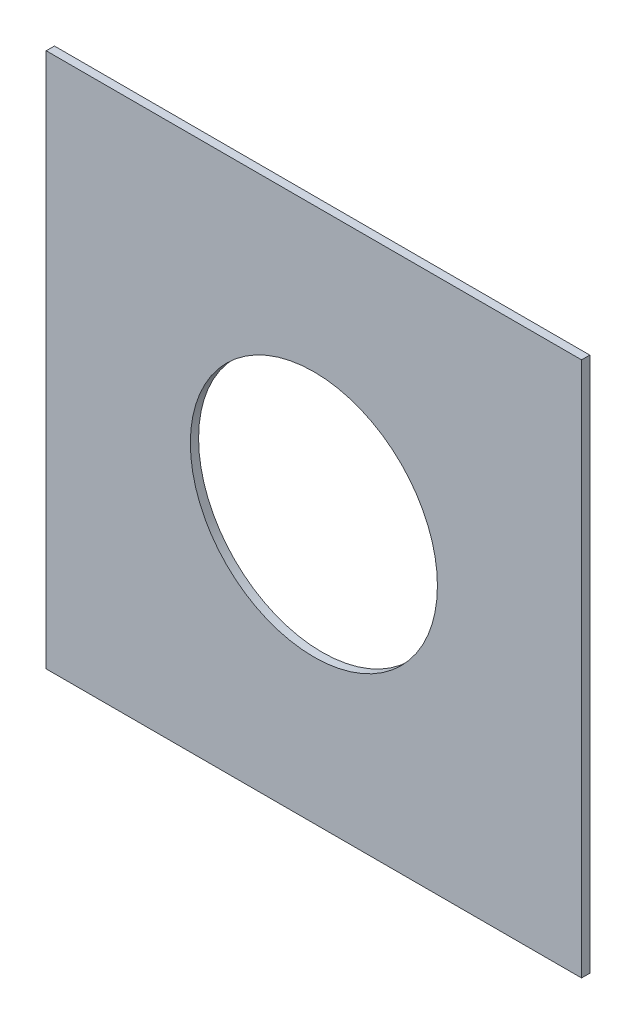
ISO-10303-21;
HEADER;
FILE_DESCRIPTION(('STEP AP214'),'2;1');
FILE_NAME('part.step','',(''),(''),'','','');
FILE_SCHEMA(('AUTOMOTIVE_DESIGN { 1 0 10303 214 1 1 1 1 }'));
ENDSEC;
DATA;
#1=APPLICATION_CONTEXT('core data for automotive mechanical design processes');
#2=APPLICATION_PROTOCOL_DEFINITION('international standard','automotive_design',2000,#1);
#3=PRODUCT_CONTEXT('',#1,'mechanical');
#4=PRODUCT('Part','Part','',(#3));
#5=PRODUCT_RELATED_PRODUCT_CATEGORY('part','',(#4));
#6=PRODUCT_DEFINITION_FORMATION('','',#4);
#7=PRODUCT_DEFINITION_CONTEXT('part definition',#1,'design');
#8=PRODUCT_DEFINITION('design','',#6,#7);
#9=PRODUCT_DEFINITION_SHAPE('','',#8);
#10=(LENGTH_UNIT() NAMED_UNIT(*) SI_UNIT(.MILLI.,.METRE.));
#11=(NAMED_UNIT(*) PLANE_ANGLE_UNIT() SI_UNIT($,.RADIAN.));
#12=(NAMED_UNIT(*) SI_UNIT($,.STERADIAN.) SOLID_ANGLE_UNIT());
#13=UNCERTAINTY_MEASURE_WITH_UNIT(LENGTH_MEASURE(1.E-05),#10,'distance_accuracy_value','');
#14=(GEOMETRIC_REPRESENTATION_CONTEXT(3) GLOBAL_UNCERTAINTY_ASSIGNED_CONTEXT((#13)) GLOBAL_UNIT_ASSIGNED_CONTEXT((#10,
#11,#12)) REPRESENTATION_CONTEXT('',''));
#15=CARTESIAN_POINT('',(0.,0.,0.));
#16=DIRECTION('',(0.,0.,1.));
#17=DIRECTION('',(1.,0.,0.));
#18=AXIS2_PLACEMENT_3D('',#15,#16,#17);
#19=CARTESIAN_POINT('',(-6.776,-3.55,-6.999));
#20=DIRECTION('',(0.,1.,0.));
#21=DIRECTION('',(1.,0.,0.));
#22=AXIS2_PLACEMENT_3D('',#19,#20,#21);
#23=PLANE('',#22);
#24=DIRECTION('',(0.,0.,1.));
#25=VECTOR('',#24,1.);
#26=CARTESIAN_POINT('',(-5.475,-3.55,-7.01));
#27=LINE('',#26,#25);
#28=CARTESIAN_POINT('',(-5.475,-3.55,-7.02));
#29=VERTEX_POINT('',#28);
#30=CARTESIAN_POINT('',(-5.475,-3.55,-7.));
#31=VERTEX_POINT('',#30);
#32=EDGE_CURVE('E62',#29,#31,#27,.T.);
#33=ORIENTED_EDGE('',*,*,#32,.F.);
#34=DIRECTION('',(1.,0.,0.));
#35=VECTOR('',#34,1.);
#36=CARTESIAN_POINT('',(-6.125,-3.55,-7.02));
#37=LINE('',#36,#35);
#38=CARTESIAN_POINT('',(-6.775,-3.55,-7.02));
#39=VERTEX_POINT('',#38);
#40=EDGE_CURVE('E87',#39,#29,#37,.T.);
#41=ORIENTED_EDGE('',*,*,#40,.F.);
#42=DIRECTION('',(0.,0.,-1.));
#43=VECTOR('',#42,1.);
#44=CARTESIAN_POINT('',(-6.775,-3.55,-7.01));
#45=LINE('',#44,#43);
#46=CARTESIAN_POINT('',(-6.775,-3.55,-7.));
#47=VERTEX_POINT('',#46);
#48=EDGE_CURVE('E73',#47,#39,#45,.T.);
#49=ORIENTED_EDGE('',*,*,#48,.F.);
#50=DIRECTION('',(-1.,0.,0.));
#51=VECTOR('',#50,1.);
#52=CARTESIAN_POINT('',(-6.125,-3.55,-7.));
#53=LINE('',#52,#51);
#54=EDGE_CURVE('E56',#31,#47,#53,.T.);
#55=ORIENTED_EDGE('',*,*,#54,.F.);
#56=EDGE_LOOP('',(#33,#41,#49,#55));
#57=FACE_BOUND('',#56,.T.);
#58=ADVANCED_FACE('F17',(#57),#23,.T.);
#59=CARTESIAN_POINT('',(-5.475,-3.549,-6.999));
#60=DIRECTION('',(1.,0.,0.));
#61=DIRECTION('',(0.,-1.,0.));
#62=AXIS2_PLACEMENT_3D('',#59,#60,#61);
#63=PLANE('',#62);
#64=DIRECTION('',(0.,0.,-1.));
#65=VECTOR('',#64,1.);
#66=CARTESIAN_POINT('',(-5.475,-4.85,-7.01));
#67=LINE('',#66,#65);
#68=CARTESIAN_POINT('',(-5.475,-4.85,-7.));
#69=VERTEX_POINT('',#68);
#70=CARTESIAN_POINT('',(-5.475,-4.85,-7.02));
#71=VERTEX_POINT('',#70);
#72=EDGE_CURVE('E71',#69,#71,#67,.T.);
#73=ORIENTED_EDGE('',*,*,#72,.T.);
#74=DIRECTION('',(0.,-1.,0.));
#75=VECTOR('',#74,1.);
#76=CARTESIAN_POINT('',(-5.475,-4.2,-7.02));
#77=LINE('',#76,#75);
#78=EDGE_CURVE('E67',#29,#71,#77,.T.);
#79=ORIENTED_EDGE('',*,*,#78,.F.);
#80=ORIENTED_EDGE('',*,*,#32,.T.);
#81=DIRECTION('',(0.,1.,0.));
#82=VECTOR('',#81,1.);
#83=CARTESIAN_POINT('',(-5.475,-4.2,-7.));
#84=LINE('',#83,#82);
#85=EDGE_CURVE('E64',#69,#31,#84,.T.);
#86=ORIENTED_EDGE('',*,*,#85,.F.);
#87=EDGE_LOOP('',(#73,#79,#80,#86));
#88=FACE_BOUND('',#87,.T.);
#89=ADVANCED_FACE('F63',(#88),#63,.T.);
#90=CARTESIAN_POINT('',(-6.125,-4.2,-7.));
#91=DIRECTION('',(0.,0.,-1.));
#92=DIRECTION('',(-1.,0.,0.));
#93=AXIS2_PLACEMENT_3D('',#90,#91,#92);
#94=CYLINDRICAL_SURFACE('',#93,0.300000000000001);
#95=CARTESIAN_POINT('',(-6.125,-4.2,-7.02));
#96=DIRECTION('',(0.,0.,-1.));
#97=DIRECTION('',(-1.,0.,0.));
#98=AXIS2_PLACEMENT_3D('',#95,#96,#97);
#99=CIRCLE('',#98,0.300000000000001);
#100=CARTESIAN_POINT('',(-6.425,-4.2,-7.02));
#101=VERTEX_POINT('',#100);
#102=EDGE_CURVE('E82',#101,#101,#99,.F.);
#103=ORIENTED_EDGE('',*,*,#102,.F.);
#104=EDGE_LOOP('',(#103));
#105=FACE_BOUND('',#104,.T.);
#106=CARTESIAN_POINT('',(-6.125,-4.2,-7.));
#107=DIRECTION('',(0.,0.,-1.));
#108=DIRECTION('',(-1.,0.,0.));
#109=AXIS2_PLACEMENT_3D('',#106,#107,#108);
#110=CIRCLE('',#109,0.300000000000001);
#111=CARTESIAN_POINT('',(-6.425,-4.2,-7.));
#112=VERTEX_POINT('',#111);
#113=EDGE_CURVE('E21',#112,#112,#110,.T.);
#114=ORIENTED_EDGE('',*,*,#113,.F.);
#115=EDGE_LOOP('',(#114));
#116=FACE_BOUND('',#115,.T.);
#117=ADVANCED_FACE('F99',(#105,#116),#94,.F.);
#118=CARTESIAN_POINT('',(-5.474,-3.549,-7.));
#119=DIRECTION('',(0.,0.,1.));
#120=DIRECTION('',(-1.,0.,0.));
#121=AXIS2_PLACEMENT_3D('',#118,#119,#120);
#122=PLANE('',#121);
#123=ORIENTED_EDGE('',*,*,#113,.T.);
#124=EDGE_LOOP('',(#123));
#125=FACE_BOUND('',#124,.T.);
#126=DIRECTION('',(0.,1.,0.));
#127=VECTOR('',#126,1.);
#128=CARTESIAN_POINT('',(-6.775,-4.2,-7.));
#129=LINE('',#128,#127);
#130=CARTESIAN_POINT('',(-6.775,-4.85,-7.));
#131=VERTEX_POINT('',#130);
#132=EDGE_CURVE('E94',#131,#47,#129,.T.);
#133=ORIENTED_EDGE('',*,*,#132,.F.);
#134=DIRECTION('',(-1.,0.,0.));
#135=VECTOR('',#134,1.);
#136=CARTESIAN_POINT('',(-6.125,-4.85,-7.));
#137=LINE('',#136,#135);
#138=EDGE_CURVE('E78',#69,#131,#137,.T.);
#139=ORIENTED_EDGE('',*,*,#138,.F.);
#140=ORIENTED_EDGE('',*,*,#85,.T.);
#141=ORIENTED_EDGE('',*,*,#54,.T.);
#142=EDGE_LOOP('',(#133,#139,#140,#141));
#143=FACE_BOUND('',#142,.T.);
#144=ADVANCED_FACE('F76',(#125,#143),#122,.T.);
#145=CARTESIAN_POINT('',(-6.775,-4.851,-6.999));
#146=DIRECTION('',(-1.,0.,0.));
#147=DIRECTION('',(0.,1.,0.));
#148=AXIS2_PLACEMENT_3D('',#145,#146,#147);
#149=PLANE('',#148);
#150=ORIENTED_EDGE('',*,*,#48,.T.);
#151=DIRECTION('',(0.,1.,0.));
#152=VECTOR('',#151,1.);
#153=CARTESIAN_POINT('',(-6.775,-4.2,-7.02));
#154=LINE('',#153,#152);
#155=CARTESIAN_POINT('',(-6.775,-4.85,-7.02));
#156=VERTEX_POINT('',#155);
#157=EDGE_CURVE('E36',#156,#39,#154,.T.);
#158=ORIENTED_EDGE('',*,*,#157,.F.);
#159=DIRECTION('',(0.,0.,-1.));
#160=VECTOR('',#159,1.);
#161=CARTESIAN_POINT('',(-6.775,-4.85,-7.01));
#162=LINE('',#161,#160);
#163=EDGE_CURVE('E27',#131,#156,#162,.T.);
#164=ORIENTED_EDGE('',*,*,#163,.F.);
#165=ORIENTED_EDGE('',*,*,#132,.T.);
#166=EDGE_LOOP('',(#150,#158,#164,#165));
#167=FACE_BOUND('',#166,.T.);
#168=ADVANCED_FACE('F108',(#167),#149,.T.);
#169=CARTESIAN_POINT('',(-6.776,-3.549,-7.02));
#170=DIRECTION('',(0.,0.,-1.));
#171=DIRECTION('',(1.,0.,0.));
#172=AXIS2_PLACEMENT_3D('',#169,#170,#171);
#173=PLANE('',#172);
#174=ORIENTED_EDGE('',*,*,#102,.T.);
#175=EDGE_LOOP('',(#174));
#176=FACE_BOUND('',#175,.T.);
#177=ORIENTED_EDGE('',*,*,#40,.T.);
#178=ORIENTED_EDGE('',*,*,#78,.T.);
#179=DIRECTION('',(1.,0.,0.));
#180=VECTOR('',#179,1.);
#181=CARTESIAN_POINT('',(-6.125,-4.85,-7.02));
#182=LINE('',#181,#180);
#183=EDGE_CURVE('E11',#156,#71,#182,.T.);
#184=ORIENTED_EDGE('',*,*,#183,.F.);
#185=ORIENTED_EDGE('',*,*,#157,.T.);
#186=EDGE_LOOP('',(#177,#178,#184,#185));
#187=FACE_BOUND('',#186,.T.);
#188=ADVANCED_FACE('F112',(#176,#187),#173,.T.);
#189=CARTESIAN_POINT('',(-5.474,-4.85,-6.999));
#190=DIRECTION('',(0.,-1.,0.));
#191=DIRECTION('',(-1.,0.,0.));
#192=AXIS2_PLACEMENT_3D('',#189,#190,#191);
#193=PLANE('',#192);
#194=ORIENTED_EDGE('',*,*,#163,.T.);
#195=ORIENTED_EDGE('',*,*,#183,.T.);
#196=ORIENTED_EDGE('',*,*,#72,.F.);
#197=ORIENTED_EDGE('',*,*,#138,.T.);
#198=EDGE_LOOP('',(#194,#195,#196,#197));
#199=FACE_BOUND('',#198,.T.);
#200=ADVANCED_FACE('F19',(#199),#193,.T.);
#201=CLOSED_SHELL('',(#58,#89,#117,#144,#168,#188,#200));
#202=MANIFOLD_SOLID_BREP('B1',#201);
#203=ADVANCED_BREP_SHAPE_REPRESENTATION('',(#18,#202),#14);
#204=SHAPE_DEFINITION_REPRESENTATION(#9,#203);
ENDSEC;
END-ISO-10303-21;
